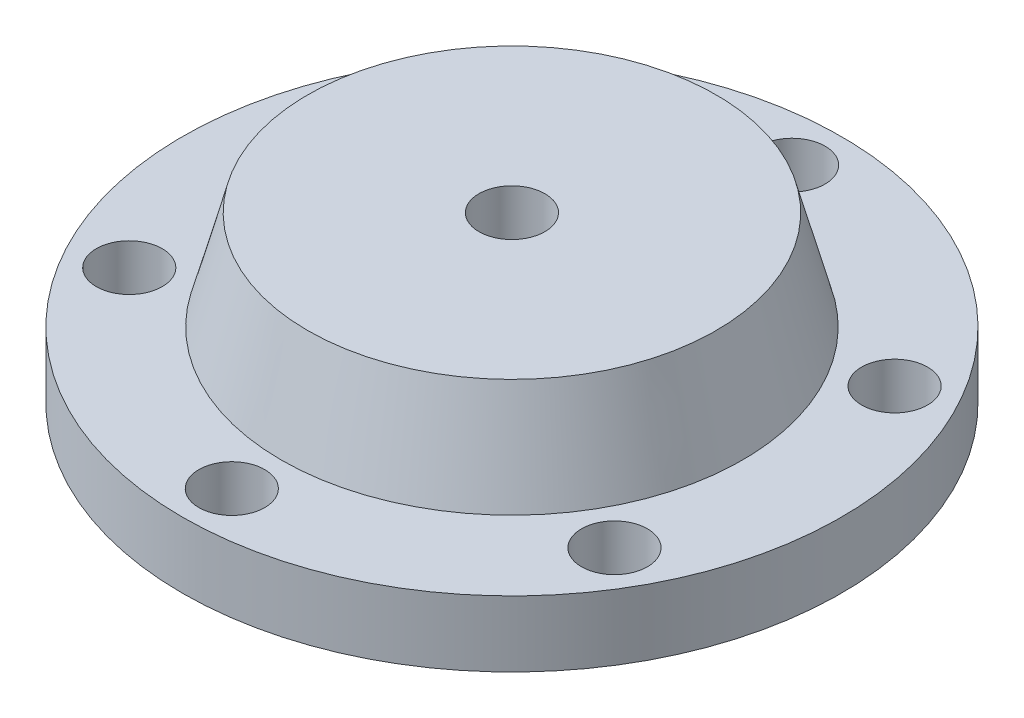
ISO-10303-21;
HEADER;
FILE_DESCRIPTION(('STEP AP214'),'2;1');
FILE_NAME('part.step','',(''),(''),'','','');
FILE_SCHEMA(('AUTOMOTIVE_DESIGN { 1 0 10303 214 1 1 1 1 }'));
ENDSEC;
DATA;
#1=APPLICATION_CONTEXT('core data for automotive mechanical design processes');
#2=APPLICATION_PROTOCOL_DEFINITION('international standard','automotive_design',2000,#1);
#3=PRODUCT_CONTEXT('',#1,'mechanical');
#4=PRODUCT('Part','Part','',(#3));
#5=PRODUCT_RELATED_PRODUCT_CATEGORY('part','',(#4));
#6=PRODUCT_DEFINITION_FORMATION('','',#4);
#7=PRODUCT_DEFINITION_CONTEXT('part definition',#1,'design');
#8=PRODUCT_DEFINITION('design','',#6,#7);
#9=PRODUCT_DEFINITION_SHAPE('','',#8);
#10=(LENGTH_UNIT() NAMED_UNIT(*) SI_UNIT(.MILLI.,.METRE.));
#11=(NAMED_UNIT(*) PLANE_ANGLE_UNIT() SI_UNIT($,.RADIAN.));
#12=(NAMED_UNIT(*) SI_UNIT($,.STERADIAN.) SOLID_ANGLE_UNIT());
#13=UNCERTAINTY_MEASURE_WITH_UNIT(LENGTH_MEASURE(1.E-05),#10,'distance_accuracy_value','');
#14=(GEOMETRIC_REPRESENTATION_CONTEXT(3) GLOBAL_UNCERTAINTY_ASSIGNED_CONTEXT((#13)) GLOBAL_UNIT_ASSIGNED_CONTEXT((#10,
#11,#12)) REPRESENTATION_CONTEXT('',''));
#15=CARTESIAN_POINT('',(0.,0.,0.));
#16=DIRECTION('',(0.,0.,1.));
#17=DIRECTION('',(1.,0.,0.));
#18=AXIS2_PLACEMENT_3D('',#15,#16,#17);
#19=CARTESIAN_POINT('',(0.,50.8,0.));
#20=DIRECTION('',(0.,1.,0.));
#21=DIRECTION('',(0.,0.,1.));
#22=AXIS2_PLACEMENT_3D('',#19,#20,#21);
#23=PLANE('',#22);
#24=CARTESIAN_POINT('',(0.,50.8,0.));
#25=DIRECTION('',(0.,1.,0.));
#26=DIRECTION('',(0.,0.,1.));
#27=AXIS2_PLACEMENT_3D('',#24,#25,#26);
#28=CIRCLE('',#27,177.8);
#29=CARTESIAN_POINT('',(0.,50.8,177.8));
#30=VERTEX_POINT('',#29);
#31=EDGE_CURVE('E86',#30,#30,#28,.T.);
#32=ORIENTED_EDGE('',*,*,#31,.F.);
#33=EDGE_LOOP('',(#32));
#34=FACE_BOUND('',#33,.T.);
#35=CARTESIAN_POINT('',(-186.974884677046,50.8,107.950000000008));
#36=DIRECTION('',(0.,1.,0.));
#37=DIRECTION('',(0.,0.,1.));
#38=AXIS2_PLACEMENT_3D('',#35,#36,#37);
#39=CIRCLE('',#38,25.4000000000175);
#40=CARTESIAN_POINT('',(-186.974884677046,50.8,133.350000000026));
#41=VERTEX_POINT('',#40);
#42=EDGE_CURVE('E69',#41,#41,#39,.T.);
#43=ORIENTED_EDGE('',*,*,#42,.F.);
#44=EDGE_LOOP('',(#43));
#45=FACE_BOUND('',#44,.T.);
#46=CARTESIAN_POINT('',(186.974884677074,50.8,107.949999999992));
#47=DIRECTION('',(0.,1.,0.));
#48=DIRECTION('',(0.,0.,1.));
#49=AXIS2_PLACEMENT_3D('',#46,#47,#48);
#50=CIRCLE('',#49,25.4000000000118);
#51=CARTESIAN_POINT('',(186.974884677074,50.8,133.350000000004));
#52=VERTEX_POINT('',#51);
#53=EDGE_CURVE('E57',#52,#52,#50,.T.);
#54=ORIENTED_EDGE('',*,*,#53,.F.);
#55=EDGE_LOOP('',(#54));
#56=FACE_BOUND('',#55,.T.);
#57=CARTESIAN_POINT('',(0.,50.8,-215.9));
#58=DIRECTION('',(0.,1.,0.));
#59=DIRECTION('',(0.,0.,1.));
#60=AXIS2_PLACEMENT_3D('',#57,#58,#59);
#61=CIRCLE('',#60,25.4);
#62=CARTESIAN_POINT('',(0.,50.8,-190.5));
#63=VERTEX_POINT('',#62);
#64=EDGE_CURVE('E46',#63,#63,#61,.T.);
#65=ORIENTED_EDGE('',*,*,#64,.F.);
#66=EDGE_LOOP('',(#65));
#67=FACE_BOUND('',#66,.T.);
#68=CARTESIAN_POINT('',(0.,50.8,0.));
#69=DIRECTION('',(0.,1.,0.));
#70=DIRECTION('',(0.,0.,1.));
#71=AXIS2_PLACEMENT_3D('',#68,#69,#70);
#72=CIRCLE('',#71,254.);
#73=CARTESIAN_POINT('',(0.,50.8,254.));
#74=VERTEX_POINT('',#73);
#75=EDGE_CURVE('E10',#74,#74,#72,.T.);
#76=ORIENTED_EDGE('',*,*,#75,.T.);
#77=EDGE_LOOP('',(#76));
#78=FACE_BOUND('',#77,.T.);
#79=CARTESIAN_POINT('',(186.974884677065,50.8,-107.950000000008));
#80=DIRECTION('',(0.,1.,0.));
#81=DIRECTION('',(0.,0.,1.));
#82=AXIS2_PLACEMENT_3D('',#79,#80,#81);
#83=CIRCLE('',#82,25.4000000000026);
#84=CARTESIAN_POINT('',(186.974884677065,50.8,-82.5500000000054));
#85=VERTEX_POINT('',#84);
#86=EDGE_CURVE('E51',#85,#85,#83,.T.);
#87=ORIENTED_EDGE('',*,*,#86,.F.);
#88=EDGE_LOOP('',(#87));
#89=FACE_BOUND('',#88,.T.);
#90=CARTESIAN_POINT('',(1.83558609492855E-11,50.8,215.9));
#91=DIRECTION('',(0.,1.,0.));
#92=DIRECTION('',(0.,0.,1.));
#93=AXIS2_PLACEMENT_3D('',#90,#91,#92);
#94=CIRCLE('',#93,25.400000000019);
#95=CARTESIAN_POINT('',(1.83558609492855E-11,50.8,241.300000000019));
#96=VERTEX_POINT('',#95);
#97=EDGE_CURVE('E63',#96,#96,#94,.T.);
#98=ORIENTED_EDGE('',*,*,#97,.F.);
#99=EDGE_LOOP('',(#98));
#100=FACE_BOUND('',#99,.T.);
#101=CARTESIAN_POINT('',(-186.974884677056,50.8,-107.949999999992));
#102=DIRECTION('',(0.,1.,0.));
#103=DIRECTION('',(0.,0.,1.));
#104=AXIS2_PLACEMENT_3D('',#101,#102,#103);
#105=CIRCLE('',#104,25.4000000000093);
#106=CARTESIAN_POINT('',(-186.974884677056,50.8,-82.5499999999826));
#107=VERTEX_POINT('',#106);
#108=EDGE_CURVE('E75',#107,#107,#105,.T.);
#109=ORIENTED_EDGE('',*,*,#108,.F.);
#110=EDGE_LOOP('',(#109));
#111=FACE_BOUND('',#110,.T.);
#112=ADVANCED_FACE('F35',(#34,#45,#56,#67,#78,#89,#100,#111),#23,.T.);
#113=CARTESIAN_POINT('',(0.,0.,0.));
#114=DIRECTION('',(0.,1.,0.));
#115=DIRECTION('',(0.,0.,1.));
#116=AXIS2_PLACEMENT_3D('',#113,#114,#115);
#117=PLANE('',#116);
#118=CARTESIAN_POINT('',(0.,0.,0.));
#119=DIRECTION('',(0.,1.,0.));
#120=DIRECTION('',(0.,0.,1.));
#121=AXIS2_PLACEMENT_3D('',#118,#119,#120);
#122=CIRCLE('',#121,254.);
#123=CARTESIAN_POINT('',(0.,0.,254.));
#124=VERTEX_POINT('',#123);
#125=EDGE_CURVE('E39',#124,#124,#122,.T.);
#126=ORIENTED_EDGE('',*,*,#125,.F.);
#127=EDGE_LOOP('',(#126));
#128=FACE_BOUND('',#127,.T.);
#129=CARTESIAN_POINT('',(0.,0.,-215.9));
#130=DIRECTION('',(0.,1.,0.));
#131=DIRECTION('',(0.,0.,1.));
#132=AXIS2_PLACEMENT_3D('',#129,#130,#131);
#133=CIRCLE('',#132,25.4);
#134=CARTESIAN_POINT('',(0.,0.,-190.5));
#135=VERTEX_POINT('',#134);
#136=EDGE_CURVE('E48',#135,#135,#133,.T.);
#137=ORIENTED_EDGE('',*,*,#136,.T.);
#138=EDGE_LOOP('',(#137));
#139=FACE_BOUND('',#138,.T.);
#140=CARTESIAN_POINT('',(186.974884677065,0.,-107.950000000008));
#141=DIRECTION('',(0.,1.,0.));
#142=DIRECTION('',(0.,0.,1.));
#143=AXIS2_PLACEMENT_3D('',#140,#141,#142);
#144=CIRCLE('',#143,25.4000000000026);
#145=CARTESIAN_POINT('',(186.974884677065,0.,-82.5500000000054));
#146=VERTEX_POINT('',#145);
#147=EDGE_CURVE('E54',#146,#146,#144,.T.);
#148=ORIENTED_EDGE('',*,*,#147,.T.);
#149=EDGE_LOOP('',(#148));
#150=FACE_BOUND('',#149,.T.);
#151=CARTESIAN_POINT('',(186.974884677074,0.,107.949999999992));
#152=DIRECTION('',(0.,1.,0.));
#153=DIRECTION('',(0.,0.,1.));
#154=AXIS2_PLACEMENT_3D('',#151,#152,#153);
#155=CIRCLE('',#154,25.4000000000118);
#156=CARTESIAN_POINT('',(186.974884677074,0.,133.350000000004));
#157=VERTEX_POINT('',#156);
#158=EDGE_CURVE('E60',#157,#157,#155,.T.);
#159=ORIENTED_EDGE('',*,*,#158,.T.);
#160=EDGE_LOOP('',(#159));
#161=FACE_BOUND('',#160,.T.);
#162=CARTESIAN_POINT('',(1.83558609492855E-11,0.,215.9));
#163=DIRECTION('',(0.,1.,0.));
#164=DIRECTION('',(0.,0.,1.));
#165=AXIS2_PLACEMENT_3D('',#162,#163,#164);
#166=CIRCLE('',#165,25.400000000019);
#167=CARTESIAN_POINT('',(1.83558609492855E-11,0.,241.300000000019));
#168=VERTEX_POINT('',#167);
#169=EDGE_CURVE('E66',#168,#168,#166,.T.);
#170=ORIENTED_EDGE('',*,*,#169,.T.);
#171=EDGE_LOOP('',(#170));
#172=FACE_BOUND('',#171,.T.);
#173=CARTESIAN_POINT('',(-186.974884677046,0.,107.950000000008));
#174=DIRECTION('',(0.,1.,0.));
#175=DIRECTION('',(0.,0.,1.));
#176=AXIS2_PLACEMENT_3D('',#173,#174,#175);
#177=CIRCLE('',#176,25.4000000000175);
#178=CARTESIAN_POINT('',(-186.974884677046,0.,133.350000000026));
#179=VERTEX_POINT('',#178);
#180=EDGE_CURVE('E72',#179,#179,#177,.T.);
#181=ORIENTED_EDGE('',*,*,#180,.T.);
#182=EDGE_LOOP('',(#181));
#183=FACE_BOUND('',#182,.T.);
#184=CARTESIAN_POINT('',(-186.974884677056,0.,-107.949999999992));
#185=DIRECTION('',(0.,1.,0.));
#186=DIRECTION('',(0.,0.,1.));
#187=AXIS2_PLACEMENT_3D('',#184,#185,#186);
#188=CIRCLE('',#187,25.4000000000093);
#189=CARTESIAN_POINT('',(-186.974884677056,0.,-82.5499999999826));
#190=VERTEX_POINT('',#189);
#191=EDGE_CURVE('E78',#190,#190,#188,.T.);
#192=ORIENTED_EDGE('',*,*,#191,.T.);
#193=EDGE_LOOP('',(#192));
#194=FACE_BOUND('',#193,.T.);
#195=ADVANCED_FACE('F119',(#128,#139,#150,#161,#172,#183,#194),#117,.F.);
#196=CARTESIAN_POINT('',(0.,50.8,0.));
#197=DIRECTION('',(0.,-1.,0.));
#198=DIRECTION('',(0.,0.,-1.));
#199=AXIS2_PLACEMENT_3D('',#196,#197,#198);
#200=CYLINDRICAL_SURFACE('',#199,254.);
#201=ORIENTED_EDGE('',*,*,#75,.F.);
#202=EDGE_LOOP('',(#201));
#203=FACE_BOUND('',#202,.T.);
#204=ORIENTED_EDGE('',*,*,#125,.T.);
#205=EDGE_LOOP('',(#204));
#206=FACE_BOUND('',#205,.T.);
#207=ADVANCED_FACE('F37',(#203,#206),#200,.T.);
#208=CARTESIAN_POINT('',(0.,50.8,-215.9));
#209=DIRECTION('',(0.,-1.,0.));
#210=DIRECTION('',(0.,0.,-1.));
#211=AXIS2_PLACEMENT_3D('',#208,#209,#210);
#212=CYLINDRICAL_SURFACE('',#211,25.4);
#213=ORIENTED_EDGE('',*,*,#64,.T.);
#214=EDGE_LOOP('',(#213));
#215=FACE_BOUND('',#214,.T.);
#216=ORIENTED_EDGE('',*,*,#136,.F.);
#217=EDGE_LOOP('',(#216));
#218=FACE_BOUND('',#217,.T.);
#219=ADVANCED_FACE('F144',(#215,#218),#212,.F.);
#220=CARTESIAN_POINT('',(186.974884677065,50.8,-107.950000000008));
#221=DIRECTION('',(0.,-1.,0.));
#222=DIRECTION('',(0.,0.,-1.));
#223=AXIS2_PLACEMENT_3D('',#220,#221,#222);
#224=CYLINDRICAL_SURFACE('',#223,25.4000000000026);
#225=ORIENTED_EDGE('',*,*,#86,.T.);
#226=EDGE_LOOP('',(#225));
#227=FACE_BOUND('',#226,.T.);
#228=ORIENTED_EDGE('',*,*,#147,.F.);
#229=EDGE_LOOP('',(#228));
#230=FACE_BOUND('',#229,.T.);
#231=ADVANCED_FACE('F151',(#227,#230),#224,.F.);
#232=CARTESIAN_POINT('',(186.974884677074,50.8,107.949999999992));
#233=DIRECTION('',(0.,-1.,0.));
#234=DIRECTION('',(0.,0.,-1.));
#235=AXIS2_PLACEMENT_3D('',#232,#233,#234);
#236=CYLINDRICAL_SURFACE('',#235,25.4000000000118);
#237=ORIENTED_EDGE('',*,*,#53,.T.);
#238=EDGE_LOOP('',(#237));
#239=FACE_BOUND('',#238,.T.);
#240=ORIENTED_EDGE('',*,*,#158,.F.);
#241=EDGE_LOOP('',(#240));
#242=FACE_BOUND('',#241,.T.);
#243=ADVANCED_FACE('F155',(#239,#242),#236,.F.);
#244=CARTESIAN_POINT('',(1.83558609492855E-11,50.8,215.9));
#245=DIRECTION('',(0.,-1.,0.));
#246=DIRECTION('',(0.,0.,-1.));
#247=AXIS2_PLACEMENT_3D('',#244,#245,#246);
#248=CYLINDRICAL_SURFACE('',#247,25.400000000019);
#249=ORIENTED_EDGE('',*,*,#97,.T.);
#250=EDGE_LOOP('',(#249));
#251=FACE_BOUND('',#250,.T.);
#252=ORIENTED_EDGE('',*,*,#169,.F.);
#253=EDGE_LOOP('',(#252));
#254=FACE_BOUND('',#253,.T.);
#255=ADVANCED_FACE('F159',(#251,#254),#248,.F.);
#256=CARTESIAN_POINT('',(-186.974884677046,50.8,107.950000000008));
#257=DIRECTION('',(0.,-1.,0.));
#258=DIRECTION('',(0.,0.,-1.));
#259=AXIS2_PLACEMENT_3D('',#256,#257,#258);
#260=CYLINDRICAL_SURFACE('',#259,25.4000000000175);
#261=ORIENTED_EDGE('',*,*,#42,.T.);
#262=EDGE_LOOP('',(#261));
#263=FACE_BOUND('',#262,.T.);
#264=ORIENTED_EDGE('',*,*,#180,.F.);
#265=EDGE_LOOP('',(#264));
#266=FACE_BOUND('',#265,.T.);
#267=ADVANCED_FACE('F135',(#263,#266),#260,.F.);
#268=CARTESIAN_POINT('',(-186.974884677056,50.8,-107.949999999992));
#269=DIRECTION('',(0.,-1.,0.));
#270=DIRECTION('',(0.,0.,-1.));
#271=AXIS2_PLACEMENT_3D('',#268,#269,#270);
#272=CYLINDRICAL_SURFACE('',#271,25.4000000000093);
#273=ORIENTED_EDGE('',*,*,#108,.T.);
#274=EDGE_LOOP('',(#273));
#275=FACE_BOUND('',#274,.T.);
#276=ORIENTED_EDGE('',*,*,#191,.F.);
#277=EDGE_LOOP('',(#276));
#278=FACE_BOUND('',#277,.T.);
#279=ADVANCED_FACE('F113',(#275,#278),#272,.F.);
#280=CARTESIAN_POINT('',(0.,50.8,0.));
#281=DIRECTION('',(0.,-1.,0.));
#282=DIRECTION('',(0.,0.,1.));
#283=AXIS2_PLACEMENT_3D('',#280,#281,#282);
#284=CONICAL_SURFACE('',#283,177.8,0.26179938779915);
#285=CARTESIAN_POINT('',(0.,127.,0.));
#286=DIRECTION('',(0.,1.,0.));
#287=DIRECTION('',(0.,0.,1.));
#288=AXIS2_PLACEMENT_3D('',#285,#286,#287);
#289=CIRCLE('',#288,157.382271536748);
#290=CARTESIAN_POINT('',(0.,127.,157.382271536748));
#291=VERTEX_POINT('',#290);
#292=EDGE_CURVE('E81',#291,#291,#289,.T.);
#293=ORIENTED_EDGE('',*,*,#292,.F.);
#294=EDGE_LOOP('',(#293));
#295=FACE_BOUND('',#294,.T.);
#296=ORIENTED_EDGE('',*,*,#31,.T.);
#297=EDGE_LOOP('',(#296));
#298=FACE_BOUND('',#297,.T.);
#299=ADVANCED_FACE('F107',(#295,#298),#284,.T.);
#300=CARTESIAN_POINT('',(0.,127.,0.));
#301=DIRECTION('',(0.,1.,0.));
#302=DIRECTION('',(0.,0.,1.));
#303=AXIS2_PLACEMENT_3D('',#300,#301,#302);
#304=PLANE('',#303);
#305=CARTESIAN_POINT('',(0.,127.,0.));
#306=DIRECTION('',(0.,1.,0.));
#307=DIRECTION('',(0.,0.,1.));
#308=AXIS2_PLACEMENT_3D('',#305,#306,#307);
#309=CIRCLE('',#308,25.4);
#310=CARTESIAN_POINT('',(0.,127.,25.4));
#311=VERTEX_POINT('',#310);
#312=EDGE_CURVE('E90',#311,#311,#309,.T.);
#313=ORIENTED_EDGE('',*,*,#312,.F.);
#314=EDGE_LOOP('',(#313));
#315=FACE_BOUND('',#314,.T.);
#316=ORIENTED_EDGE('',*,*,#292,.T.);
#317=EDGE_LOOP('',(#316));
#318=FACE_BOUND('',#317,.T.);
#319=ADVANCED_FACE('F101',(#315,#318),#304,.T.);
#320=CARTESIAN_POINT('',(0.,50.8,0.));
#321=DIRECTION('',(0.,1.,0.));
#322=DIRECTION('',(0.,0.,1.));
#323=AXIS2_PLACEMENT_3D('',#320,#321,#322);
#324=CYLINDRICAL_SURFACE('',#323,25.4);
#325=CARTESIAN_POINT('',(0.,50.8,0.));
#326=DIRECTION('',(0.,1.,0.));
#327=DIRECTION('',(0.,0.,1.));
#328=AXIS2_PLACEMENT_3D('',#325,#326,#327);
#329=CIRCLE('',#328,25.4);
#330=CARTESIAN_POINT('',(0.,50.8,25.4));
#331=VERTEX_POINT('',#330);
#332=EDGE_CURVE('E89',#331,#331,#329,.T.);
#333=ORIENTED_EDGE('',*,*,#332,.F.);
#334=EDGE_LOOP('',(#333));
#335=FACE_BOUND('',#334,.T.);
#336=ORIENTED_EDGE('',*,*,#312,.T.);
#337=EDGE_LOOP('',(#336));
#338=FACE_BOUND('',#337,.T.);
#339=ADVANCED_FACE('F98',(#335,#338),#324,.F.);
#340=CARTESIAN_POINT('',(0.,50.8,0.));
#341=DIRECTION('',(0.,1.,0.));
#342=DIRECTION('',(0.,0.,1.));
#343=AXIS2_PLACEMENT_3D('',#340,#341,#342);
#344=PLANE('',#343);
#345=ORIENTED_EDGE('',*,*,#332,.T.);
#346=EDGE_LOOP('',(#345));
#347=FACE_BOUND('',#346,.T.);
#348=ADVANCED_FACE('F96',(#347),#344,.T.);
#349=CLOSED_SHELL('',(#112,#195,#207,#219,#231,#243,#255,#267,#279,#299,#319,#339,#348));
#350=MANIFOLD_SOLID_BREP('B2',#349);
#351=ADVANCED_BREP_SHAPE_REPRESENTATION('',(#18,#350),#14);
#352=SHAPE_DEFINITION_REPRESENTATION(#9,#351);
ENDSEC;
END-ISO-10303-21;
